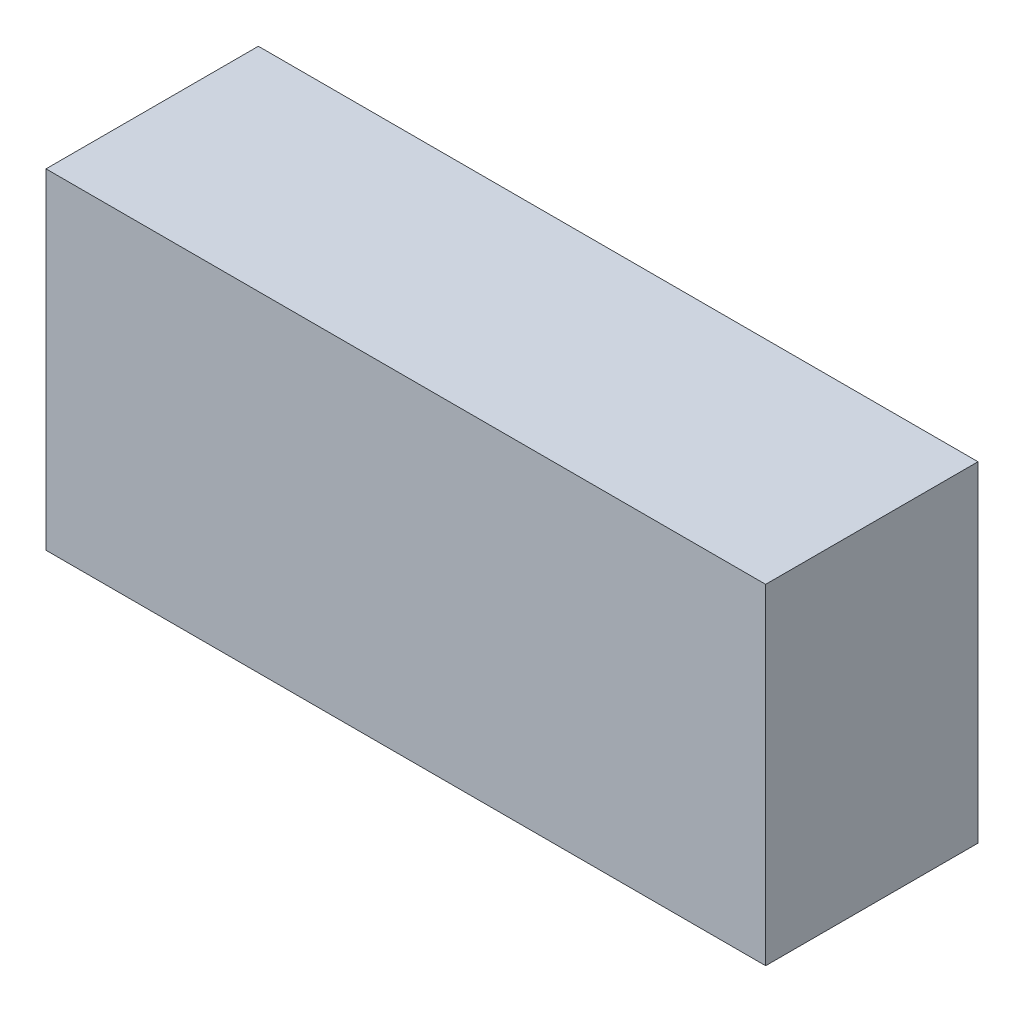
ISO-10303-21;
HEADER;
FILE_DESCRIPTION(('STEP AP214'),'2;1');
FILE_NAME('part.step','',(''),(''),'','','');
FILE_SCHEMA(('AUTOMOTIVE_DESIGN { 1 0 10303 214 1 1 1 1 }'));
ENDSEC;
DATA;
#1=APPLICATION_CONTEXT('core data for automotive mechanical design processes');
#2=APPLICATION_PROTOCOL_DEFINITION('international standard','automotive_design',2000,#1);
#3=PRODUCT_CONTEXT('',#1,'mechanical');
#4=PRODUCT('Part','Part','',(#3));
#5=PRODUCT_RELATED_PRODUCT_CATEGORY('part','',(#4));
#6=PRODUCT_DEFINITION_FORMATION('','',#4);
#7=PRODUCT_DEFINITION_CONTEXT('part definition',#1,'design');
#8=PRODUCT_DEFINITION('design','',#6,#7);
#9=PRODUCT_DEFINITION_SHAPE('','',#8);
#10=(LENGTH_UNIT() NAMED_UNIT(*) SI_UNIT(.MILLI.,.METRE.));
#11=(NAMED_UNIT(*) PLANE_ANGLE_UNIT() SI_UNIT($,.RADIAN.));
#12=(NAMED_UNIT(*) SI_UNIT($,.STERADIAN.) SOLID_ANGLE_UNIT());
#13=UNCERTAINTY_MEASURE_WITH_UNIT(LENGTH_MEASURE(1.E-05),#10,'distance_accuracy_value','');
#14=(GEOMETRIC_REPRESENTATION_CONTEXT(3) GLOBAL_UNCERTAINTY_ASSIGNED_CONTEXT((#13)) GLOBAL_UNIT_ASSIGNED_CONTEXT((#10,
#11,#12)) REPRESENTATION_CONTEXT('',''));
#15=CARTESIAN_POINT('',(0.,0.,0.));
#16=DIRECTION('',(0.,0.,1.));
#17=DIRECTION('',(1.,0.,0.));
#18=AXIS2_PLACEMENT_3D('',#15,#16,#17);
#19=CARTESIAN_POINT('',(-0.7747,0.3556,0.4572));
#20=DIRECTION('',(0.,0.,1.));
#21=DIRECTION('',(1.,0.,0.));
#22=AXIS2_PLACEMENT_3D('',#19,#20,#21);
#23=PLANE('',#22);
#24=DIRECTION('',(0.,1.,0.));
#25=VECTOR('',#24,1.);
#26=CARTESIAN_POINT('',(0.7747,0.3556,0.4572));
#27=LINE('',#26,#25);
#28=CARTESIAN_POINT('',(0.7747,0.3556,0.4572));
#29=VERTEX_POINT('',#28);
#30=CARTESIAN_POINT('',(0.7747,-0.3556,0.4572));
#31=VERTEX_POINT('',#30);
#32=EDGE_CURVE('E53',#29,#31,#27,.F.);
#33=ORIENTED_EDGE('',*,*,#32,.F.);
#34=DIRECTION('',(1.,0.,0.));
#35=VECTOR('',#34,1.);
#36=CARTESIAN_POINT('',(-0.7747,0.3556,0.4572));
#37=LINE('',#36,#35);
#38=CARTESIAN_POINT('',(-0.7747,0.3556,0.4572));
#39=VERTEX_POINT('',#38);
#40=EDGE_CURVE('E68',#39,#29,#37,.T.);
#41=ORIENTED_EDGE('',*,*,#40,.F.);
#42=DIRECTION('',(0.,1.,0.));
#43=VECTOR('',#42,1.);
#44=CARTESIAN_POINT('',(-0.7747,-0.3556,0.4572));
#45=LINE('',#44,#43);
#46=CARTESIAN_POINT('',(-0.7747,-0.3556,0.4572));
#47=VERTEX_POINT('',#46);
#48=EDGE_CURVE('E20',#47,#39,#45,.T.);
#49=ORIENTED_EDGE('',*,*,#48,.F.);
#50=DIRECTION('',(1.,0.,0.));
#51=VECTOR('',#50,1.);
#52=CARTESIAN_POINT('',(0.7747,-0.3556,0.4572));
#53=LINE('',#52,#51);
#54=EDGE_CURVE('E58',#31,#47,#53,.F.);
#55=ORIENTED_EDGE('',*,*,#54,.F.);
#56=EDGE_LOOP('',(#33,#41,#49,#55));
#57=FACE_BOUND('',#56,.T.);
#58=ADVANCED_FACE('F17',(#57),#23,.T.);
#59=CARTESIAN_POINT('',(-0.7747,-0.3556,0.));
#60=DIRECTION('',(-1.,0.,0.));
#61=DIRECTION('',(0.,0.,1.));
#62=AXIS2_PLACEMENT_3D('',#59,#60,#61);
#63=PLANE('',#62);
#64=DIRECTION('',(0.,0.,1.));
#65=VECTOR('',#64,1.);
#66=CARTESIAN_POINT('',(-0.7747,0.3556,0.));
#67=LINE('',#66,#65);
#68=CARTESIAN_POINT('',(-0.7747,0.3556,0.));
#69=VERTEX_POINT('',#68);
#70=EDGE_CURVE('E79',#69,#39,#67,.T.);
#71=ORIENTED_EDGE('',*,*,#70,.F.);
#72=DIRECTION('',(0.,1.,0.));
#73=VECTOR('',#72,1.);
#74=CARTESIAN_POINT('',(-0.7747,0.3556,0.));
#75=LINE('',#74,#73);
#76=CARTESIAN_POINT('',(-0.7747,-0.3556,0.));
#77=VERTEX_POINT('',#76);
#78=EDGE_CURVE('E74',#69,#77,#75,.F.);
#79=ORIENTED_EDGE('',*,*,#78,.T.);
#80=DIRECTION('',(0.,0.,-1.));
#81=VECTOR('',#80,1.);
#82=CARTESIAN_POINT('',(-0.7747,-0.3556,0.));
#83=LINE('',#82,#81);
#84=EDGE_CURVE('E63',#47,#77,#83,.T.);
#85=ORIENTED_EDGE('',*,*,#84,.F.);
#86=ORIENTED_EDGE('',*,*,#48,.T.);
#87=EDGE_LOOP('',(#71,#79,#85,#86));
#88=FACE_BOUND('',#87,.T.);
#89=ADVANCED_FACE('F73',(#88),#63,.T.);
#90=CARTESIAN_POINT('',(0.7747,-0.3556,0.));
#91=DIRECTION('',(0.,-1.,0.));
#92=DIRECTION('',(0.,0.,-1.));
#93=AXIS2_PLACEMENT_3D('',#90,#91,#92);
#94=PLANE('',#93);
#95=ORIENTED_EDGE('',*,*,#84,.T.);
#96=DIRECTION('',(1.,0.,0.));
#97=VECTOR('',#96,1.);
#98=CARTESIAN_POINT('',(-0.7747,-0.3556,0.));
#99=LINE('',#98,#97);
#100=CARTESIAN_POINT('',(0.7747,-0.3556,0.));
#101=VERTEX_POINT('',#100);
#102=EDGE_CURVE('E84',#77,#101,#99,.T.);
#103=ORIENTED_EDGE('',*,*,#102,.T.);
#104=DIRECTION('',(0.,0.,-1.));
#105=VECTOR('',#104,1.);
#106=CARTESIAN_POINT('',(0.7747,-0.3556,0.));
#107=LINE('',#106,#105);
#108=EDGE_CURVE('E65',#31,#101,#107,.T.);
#109=ORIENTED_EDGE('',*,*,#108,.F.);
#110=ORIENTED_EDGE('',*,*,#54,.T.);
#111=EDGE_LOOP('',(#95,#103,#109,#110));
#112=FACE_BOUND('',#111,.T.);
#113=ADVANCED_FACE('F60',(#112),#94,.T.);
#114=CARTESIAN_POINT('',(0.7747,0.3556,0.));
#115=DIRECTION('',(1.,0.,0.));
#116=DIRECTION('',(0.,0.,-1.));
#117=AXIS2_PLACEMENT_3D('',#114,#115,#116);
#118=PLANE('',#117);
#119=ORIENTED_EDGE('',*,*,#108,.T.);
#120=DIRECTION('',(0.,1.,0.));
#121=VECTOR('',#120,1.);
#122=CARTESIAN_POINT('',(0.7747,0.3556,0.));
#123=LINE('',#122,#121);
#124=CARTESIAN_POINT('',(0.7747,0.3556,0.));
#125=VERTEX_POINT('',#124);
#126=EDGE_CURVE('E26',#101,#125,#123,.T.);
#127=ORIENTED_EDGE('',*,*,#126,.T.);
#128=DIRECTION('',(0.,0.,1.));
#129=VECTOR('',#128,1.);
#130=CARTESIAN_POINT('',(0.7747,0.3556,0.));
#131=LINE('',#130,#129);
#132=EDGE_CURVE('E34',#29,#125,#131,.F.);
#133=ORIENTED_EDGE('',*,*,#132,.F.);
#134=ORIENTED_EDGE('',*,*,#32,.T.);
#135=EDGE_LOOP('',(#119,#127,#133,#134));
#136=FACE_BOUND('',#135,.T.);
#137=ADVANCED_FACE('F88',(#136),#118,.T.);
#138=CARTESIAN_POINT('',(-0.7747,0.3556,0.));
#139=DIRECTION('',(0.,1.,0.));
#140=DIRECTION('',(0.,0.,1.));
#141=AXIS2_PLACEMENT_3D('',#138,#139,#140);
#142=PLANE('',#141);
#143=ORIENTED_EDGE('',*,*,#132,.T.);
#144=DIRECTION('',(1.,0.,0.));
#145=VECTOR('',#144,1.);
#146=CARTESIAN_POINT('',(-0.7747,0.3556,0.));
#147=LINE('',#146,#145);
#148=EDGE_CURVE('E11',#125,#69,#147,.F.);
#149=ORIENTED_EDGE('',*,*,#148,.T.);
#150=ORIENTED_EDGE('',*,*,#70,.T.);
#151=ORIENTED_EDGE('',*,*,#40,.T.);
#152=EDGE_LOOP('',(#143,#149,#150,#151));
#153=FACE_BOUND('',#152,.T.);
#154=ADVANCED_FACE('F91',(#153),#142,.T.);
#155=CARTESIAN_POINT('',(-0.7747,0.3556,0.));
#156=DIRECTION('',(0.,0.,1.));
#157=DIRECTION('',(1.,0.,0.));
#158=AXIS2_PLACEMENT_3D('',#155,#156,#157);
#159=PLANE('',#158);
#160=ORIENTED_EDGE('',*,*,#126,.F.);
#161=ORIENTED_EDGE('',*,*,#102,.F.);
#162=ORIENTED_EDGE('',*,*,#78,.F.);
#163=ORIENTED_EDGE('',*,*,#148,.F.);
#164=EDGE_LOOP('',(#160,#161,#162,#163));
#165=FACE_BOUND('',#164,.T.);
#166=ADVANCED_FACE('F90',(#165),#159,.F.);
#167=CLOSED_SHELL('',(#58,#89,#113,#137,#154,#166));
#168=MANIFOLD_SOLID_BREP('B1',#167);
#169=ADVANCED_BREP_SHAPE_REPRESENTATION('',(#18,#168),#14);
#170=SHAPE_DEFINITION_REPRESENTATION(#9,#169);
ENDSEC;
END-ISO-10303-21;
